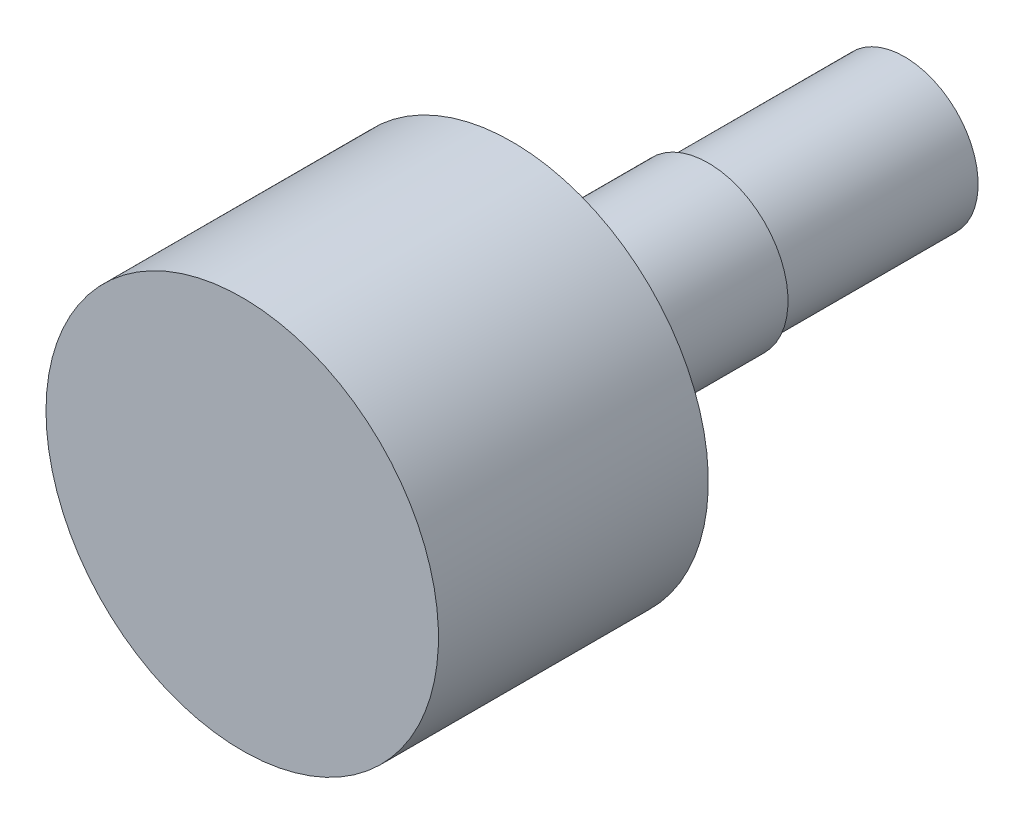
ISO-10303-21;
HEADER;
FILE_DESCRIPTION(('STEP AP214'),'2;1');
FILE_NAME('part.step','',(''),(''),'','','');
FILE_SCHEMA(('AUTOMOTIVE_DESIGN { 1 0 10303 214 1 1 1 1 }'));
ENDSEC;
DATA;
#1=APPLICATION_CONTEXT('core data for automotive mechanical design processes');
#2=APPLICATION_PROTOCOL_DEFINITION('international standard','automotive_design',2000,#1);
#3=PRODUCT_CONTEXT('',#1,'mechanical');
#4=PRODUCT('Part','Part','',(#3));
#5=PRODUCT_RELATED_PRODUCT_CATEGORY('part','',(#4));
#6=PRODUCT_DEFINITION_FORMATION('','',#4);
#7=PRODUCT_DEFINITION_CONTEXT('part definition',#1,'design');
#8=PRODUCT_DEFINITION('design','',#6,#7);
#9=PRODUCT_DEFINITION_SHAPE('','',#8);
#10=(LENGTH_UNIT() NAMED_UNIT(*) SI_UNIT(.MILLI.,.METRE.));
#11=(NAMED_UNIT(*) PLANE_ANGLE_UNIT() SI_UNIT($,.RADIAN.));
#12=(NAMED_UNIT(*) SI_UNIT($,.STERADIAN.) SOLID_ANGLE_UNIT());
#13=UNCERTAINTY_MEASURE_WITH_UNIT(LENGTH_MEASURE(1.E-05),#10,'distance_accuracy_value','');
#14=(GEOMETRIC_REPRESENTATION_CONTEXT(3) GLOBAL_UNCERTAINTY_ASSIGNED_CONTEXT((#13)) GLOBAL_UNIT_ASSIGNED_CONTEXT((#10,
#11,#12)) REPRESENTATION_CONTEXT('',''));
#15=CARTESIAN_POINT('',(0.,0.,0.));
#16=DIRECTION('',(0.,0.,1.));
#17=DIRECTION('',(1.,0.,0.));
#18=AXIS2_PLACEMENT_3D('',#15,#16,#17);
#19=CARTESIAN_POINT('',(0.,0.,0.));
#20=DIRECTION('',(0.,0.,1.));
#21=DIRECTION('',(1.,0.,0.));
#22=AXIS2_PLACEMENT_3D('',#19,#20,#21);
#23=PLANE('',#22);
#24=CARTESIAN_POINT('',(0.,0.,0.));
#25=DIRECTION('',(0.,0.,-1.));
#26=DIRECTION('',(-1.,0.,0.));
#27=AXIS2_PLACEMENT_3D('',#24,#25,#26);
#28=CIRCLE('',#27,8.);
#29=CARTESIAN_POINT('',(-8.,0.,0.));
#30=VERTEX_POINT('',#29);
#31=EDGE_CURVE('E10',#30,#30,#28,.T.);
#32=ORIENTED_EDGE('',*,*,#31,.F.);
#33=EDGE_LOOP('',(#32));
#34=FACE_BOUND('',#33,.T.);
#35=ADVANCED_FACE('F34',(#34),#23,.T.);
#36=CARTESIAN_POINT('',(0.,0.,0.));
#37=DIRECTION('',(0.,0.,-1.));
#38=DIRECTION('',(-1.,0.,0.));
#39=AXIS2_PLACEMENT_3D('',#36,#37,#38);
#40=CYLINDRICAL_SURFACE('',#39,8.);
#41=ORIENTED_EDGE('',*,*,#31,.T.);
#42=EDGE_LOOP('',(#41));
#43=FACE_BOUND('',#42,.T.);
#44=CARTESIAN_POINT('',(0.,0.,-11.));
#45=DIRECTION('',(0.,0.,-1.));
#46=DIRECTION('',(-1.,0.,0.));
#47=AXIS2_PLACEMENT_3D('',#44,#45,#46);
#48=CIRCLE('',#47,8.);
#49=CARTESIAN_POINT('',(-8.,0.,-11.));
#50=VERTEX_POINT('',#49);
#51=EDGE_CURVE('E40',#50,#50,#48,.T.);
#52=ORIENTED_EDGE('',*,*,#51,.F.);
#53=EDGE_LOOP('',(#52));
#54=FACE_BOUND('',#53,.T.);
#55=ADVANCED_FACE('F85',(#43,#54),#40,.T.);
#56=CARTESIAN_POINT('',(0.,8.,-11.));
#57=DIRECTION('',(0.,0.,-1.));
#58=DIRECTION('',(-1.,0.,0.));
#59=AXIS2_PLACEMENT_3D('',#56,#57,#58);
#60=PLANE('',#59);
#61=ORIENTED_EDGE('',*,*,#51,.T.);
#62=EDGE_LOOP('',(#61));
#63=FACE_BOUND('',#62,.T.);
#64=CARTESIAN_POINT('',(0.,0.,-11.));
#65=DIRECTION('',(0.,0.,-1.));
#66=DIRECTION('',(-1.,0.,0.));
#67=AXIS2_PLACEMENT_3D('',#64,#65,#66);
#68=CIRCLE('',#67,3.25);
#69=CARTESIAN_POINT('',(-3.25,0.,-11.));
#70=VERTEX_POINT('',#69);
#71=EDGE_CURVE('E45',#70,#70,#68,.T.);
#72=ORIENTED_EDGE('',*,*,#71,.F.);
#73=EDGE_LOOP('',(#72));
#74=FACE_BOUND('',#73,.T.);
#75=ADVANCED_FACE('F90',(#63,#74),#60,.T.);
#76=CARTESIAN_POINT('',(0.,0.,0.));
#77=DIRECTION('',(0.,0.,-1.));
#78=DIRECTION('',(-1.,0.,0.));
#79=AXIS2_PLACEMENT_3D('',#76,#77,#78);
#80=CYLINDRICAL_SURFACE('',#79,3.25);
#81=ORIENTED_EDGE('',*,*,#71,.T.);
#82=EDGE_LOOP('',(#81));
#83=FACE_BOUND('',#82,.T.);
#84=CARTESIAN_POINT('',(0.,0.,-19.));
#85=DIRECTION('',(0.,0.,-1.));
#86=DIRECTION('',(-1.,0.,0.));
#87=AXIS2_PLACEMENT_3D('',#84,#85,#86);
#88=CIRCLE('',#87,3.25);
#89=CARTESIAN_POINT('',(-3.25,0.,-19.));
#90=VERTEX_POINT('',#89);
#91=EDGE_CURVE('E52',#90,#90,#88,.T.);
#92=ORIENTED_EDGE('',*,*,#91,.F.);
#93=EDGE_LOOP('',(#92));
#94=FACE_BOUND('',#93,.T.);
#95=ADVANCED_FACE('F81',(#83,#94),#80,.T.);
#96=CARTESIAN_POINT('',(0.,3.25,-19.));
#97=DIRECTION('',(0.,0.,-1.));
#98=DIRECTION('',(-1.,0.,0.));
#99=AXIS2_PLACEMENT_3D('',#96,#97,#98);
#100=PLANE('',#99);
#101=ORIENTED_EDGE('',*,*,#91,.T.);
#102=EDGE_LOOP('',(#101));
#103=FACE_BOUND('',#102,.T.);
#104=CARTESIAN_POINT('',(0.,0.,-19.));
#105=DIRECTION('',(0.,0.,-1.));
#106=DIRECTION('',(-1.,0.,0.));
#107=AXIS2_PLACEMENT_3D('',#104,#105,#106);
#108=CIRCLE('',#107,3.);
#109=CARTESIAN_POINT('',(-3.,0.,-19.));
#110=VERTEX_POINT('',#109);
#111=EDGE_CURVE('E58',#110,#110,#108,.T.);
#112=ORIENTED_EDGE('',*,*,#111,.F.);
#113=EDGE_LOOP('',(#112));
#114=FACE_BOUND('',#113,.T.);
#115=ADVANCED_FACE('F73',(#103,#114),#100,.T.);
#116=CARTESIAN_POINT('',(0.,0.,0.));
#117=DIRECTION('',(0.,0.,-1.));
#118=DIRECTION('',(-1.,0.,0.));
#119=AXIS2_PLACEMENT_3D('',#116,#117,#118);
#120=CYLINDRICAL_SURFACE('',#119,3.);
#121=ORIENTED_EDGE('',*,*,#111,.T.);
#122=EDGE_LOOP('',(#121));
#123=FACE_BOUND('',#122,.T.);
#124=CARTESIAN_POINT('',(0.,0.,-27.));
#125=DIRECTION('',(0.,0.,-1.));
#126=DIRECTION('',(-1.,0.,0.));
#127=AXIS2_PLACEMENT_3D('',#124,#125,#126);
#128=CIRCLE('',#127,3.);
#129=CARTESIAN_POINT('',(-3.,0.,-27.));
#130=VERTEX_POINT('',#129);
#131=EDGE_CURVE('E62',#130,#130,#128,.T.);
#132=ORIENTED_EDGE('',*,*,#131,.F.);
#133=EDGE_LOOP('',(#132));
#134=FACE_BOUND('',#133,.T.);
#135=ADVANCED_FACE('F71',(#123,#134),#120,.T.);
#136=CARTESIAN_POINT('',(0.,3.,-27.));
#137=DIRECTION('',(0.,0.,-1.));
#138=DIRECTION('',(-1.,0.,0.));
#139=AXIS2_PLACEMENT_3D('',#136,#137,#138);
#140=PLANE('',#139);
#141=ORIENTED_EDGE('',*,*,#131,.T.);
#142=EDGE_LOOP('',(#141));
#143=FACE_BOUND('',#142,.T.);
#144=ADVANCED_FACE('F69',(#143),#140,.T.);
#145=CLOSED_SHELL('',(#35,#55,#75,#95,#115,#135,#144));
#146=MANIFOLD_SOLID_BREP('B2',#145);
#147=ADVANCED_BREP_SHAPE_REPRESENTATION('',(#18,#146),#14);
#148=SHAPE_DEFINITION_REPRESENTATION(#9,#147);
ENDSEC;
END-ISO-10303-21;
